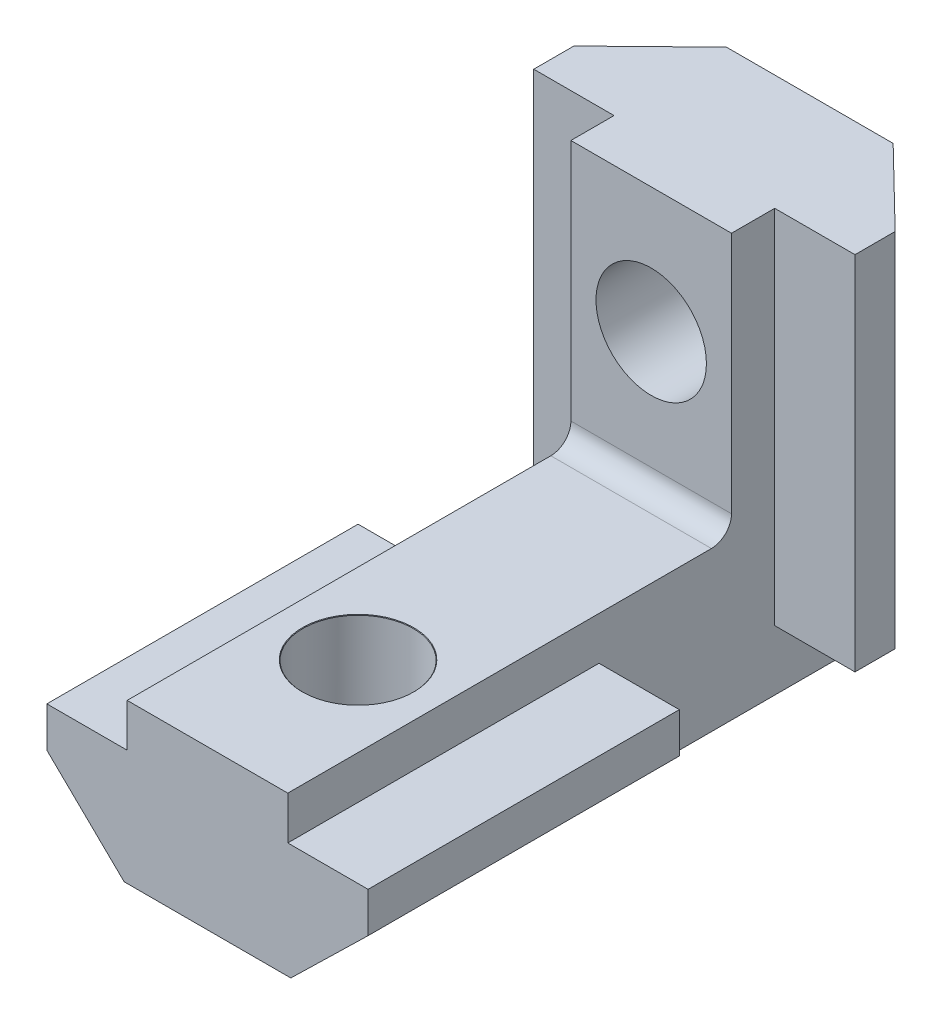
ISO-10303-21;
HEADER;
FILE_DESCRIPTION(('STEP AP214'),'2;1');
FILE_NAME('part.step','',(''),(''),'','','');
FILE_SCHEMA(('AUTOMOTIVE_DESIGN { 1 0 10303 214 1 1 1 1 }'));
ENDSEC;
DATA;
#1=APPLICATION_CONTEXT('core data for automotive mechanical design processes');
#2=APPLICATION_PROTOCOL_DEFINITION('international standard','automotive_design',2000,#1);
#3=PRODUCT_CONTEXT('',#1,'mechanical');
#4=PRODUCT('Part','Part','',(#3));
#5=PRODUCT_RELATED_PRODUCT_CATEGORY('part','',(#4));
#6=PRODUCT_DEFINITION_FORMATION('','',#4);
#7=PRODUCT_DEFINITION_CONTEXT('part definition',#1,'design');
#8=PRODUCT_DEFINITION('design','',#6,#7);
#9=PRODUCT_DEFINITION_SHAPE('','',#8);
#10=(LENGTH_UNIT() NAMED_UNIT(*) SI_UNIT(.MILLI.,.METRE.));
#11=(NAMED_UNIT(*) PLANE_ANGLE_UNIT() SI_UNIT($,.RADIAN.));
#12=(NAMED_UNIT(*) SI_UNIT($,.STERADIAN.) SOLID_ANGLE_UNIT());
#13=UNCERTAINTY_MEASURE_WITH_UNIT(LENGTH_MEASURE(1.E-05),#10,'distance_accuracy_value','');
#14=(GEOMETRIC_REPRESENTATION_CONTEXT(3) GLOBAL_UNCERTAINTY_ASSIGNED_CONTEXT((#13)) GLOBAL_UNIT_ASSIGNED_CONTEXT((#10,
#11,#12)) REPRESENTATION_CONTEXT('',''));
#15=CARTESIAN_POINT('',(0.,0.,0.));
#16=DIRECTION('',(0.,0.,1.));
#17=DIRECTION('',(1.,0.,0.));
#18=AXIS2_PLACEMENT_3D('',#15,#16,#17);
#19=CARTESIAN_POINT('',(-4.,7.9,-15.5));
#20=DIRECTION('',(-1.,0.,0.));
#21=DIRECTION('',(0.,0.,1.));
#22=AXIS2_PLACEMENT_3D('',#19,#20,#21);
#23=PLANE('',#22);
#24=DIRECTION('',(0.,0.,1.));
#25=VECTOR('',#24,1.);
#26=CARTESIAN_POINT('',(-4.,7.9,-15.5));
#27=LINE('',#26,#25);
#28=CARTESIAN_POINT('',(-4.,7.9,-21.1));
#29=VERTEX_POINT('',#28);
#30=CARTESIAN_POINT('',(-4.,7.9,0.));
#31=VERTEX_POINT('',#30);
#32=EDGE_CURVE('E308',#29,#31,#27,.T.);
#33=ORIENTED_EDGE('',*,*,#32,.F.);
#34=CARTESIAN_POINT('',(-4.,8.9,-21.1));
#35=DIRECTION('',(-1.,0.,0.));
#36=DIRECTION('',(0.,0.,1.));
#37=AXIS2_PLACEMENT_3D('',#34,#35,#36);
#38=CIRCLE('',#37,1.);
#39=CARTESIAN_POINT('',(-4.,8.9,-22.1));
#40=VERTEX_POINT('',#39);
#41=EDGE_CURVE('E46',#29,#40,#38,.F.);
#42=ORIENTED_EDGE('',*,*,#41,.T.);
#43=DIRECTION('',(0.,1.,0.));
#44=VECTOR('',#43,1.);
#45=CARTESIAN_POINT('',(-4.,-32.8440466262561,-22.1));
#46=LINE('',#45,#44);
#47=CARTESIAN_POINT('',(-4.,21.,-22.1));
#48=VERTEX_POINT('',#47);
#49=EDGE_CURVE('E250',#40,#48,#46,.T.);
#50=ORIENTED_EDGE('',*,*,#49,.T.);
#51=DIRECTION('',(0.,0.,-1.));
#52=VECTOR('',#51,1.);
#53=CARTESIAN_POINT('',(-4.,21.,-24.25));
#54=LINE('',#53,#52);
#55=CARTESIAN_POINT('',(-4.,21.,-24.25));
#56=VERTEX_POINT('',#55);
#57=EDGE_CURVE('E252',#48,#56,#54,.T.);
#58=ORIENTED_EDGE('',*,*,#57,.T.);
#59=DIRECTION('',(0.,1.,0.));
#60=VECTOR('',#59,1.);
#61=CARTESIAN_POINT('',(-4.,-32.8440466262561,-24.25));
#62=LINE('',#61,#60);
#63=CARTESIAN_POINT('',(-4.,3.,-24.25));
#64=VERTEX_POINT('',#63);
#65=EDGE_CURVE('E253',#64,#56,#62,.T.);
#66=ORIENTED_EDGE('',*,*,#65,.F.);
#67=DIRECTION('',(0.,0.,1.));
#68=VECTOR('',#67,1.);
#69=CARTESIAN_POINT('',(-4.,3.,-15.5));
#70=LINE('',#69,#68);
#71=CARTESIAN_POINT('',(-4.,3.,-30.));
#72=VERTEX_POINT('',#71);
#73=EDGE_CURVE('E221',#72,#64,#70,.T.);
#74=ORIENTED_EDGE('',*,*,#73,.F.);
#75=DIRECTION('',(0.,1.,0.));
#76=VECTOR('',#75,1.);
#77=CARTESIAN_POINT('',(-4.,0.,-30.));
#78=LINE('',#77,#76);
#79=CARTESIAN_POINT('',(-4.,0.,-30.));
#80=VERTEX_POINT('',#79);
#81=EDGE_CURVE('E208',#80,#72,#78,.T.);
#82=ORIENTED_EDGE('',*,*,#81,.F.);
#83=DIRECTION('',(0.,0.,1.));
#84=VECTOR('',#83,1.);
#85=CARTESIAN_POINT('',(-4.,0.,-30.));
#86=LINE('',#85,#84);
#87=CARTESIAN_POINT('',(-4.,0.,-15.5));
#88=VERTEX_POINT('',#87);
#89=EDGE_CURVE('E271',#80,#88,#86,.T.);
#90=ORIENTED_EDGE('',*,*,#89,.T.);
#91=DIRECTION('',(0.,1.,0.));
#92=VECTOR('',#91,1.);
#93=CARTESIAN_POINT('',(-4.,0.,-15.5));
#94=LINE('',#93,#92);
#95=CARTESIAN_POINT('',(-4.,5.75,-15.5));
#96=VERTEX_POINT('',#95);
#97=EDGE_CURVE('E265',#88,#96,#94,.T.);
#98=ORIENTED_EDGE('',*,*,#97,.T.);
#99=DIRECTION('',(0.,0.,1.));
#100=VECTOR('',#99,1.);
#101=CARTESIAN_POINT('',(-4.,5.75,-15.5));
#102=LINE('',#101,#100);
#103=CARTESIAN_POINT('',(-4.,5.75,0.));
#104=VERTEX_POINT('',#103);
#105=EDGE_CURVE('E305',#96,#104,#102,.T.);
#106=ORIENTED_EDGE('',*,*,#105,.T.);
#107=DIRECTION('',(0.,-1.,0.));
#108=VECTOR('',#107,1.);
#109=CARTESIAN_POINT('',(-4.,7.9,0.));
#110=LINE('',#109,#108);
#111=EDGE_CURVE('E331',#31,#104,#110,.T.);
#112=ORIENTED_EDGE('',*,*,#111,.F.);
#113=EDGE_LOOP('',(#33,#42,#50,#58,#66,#74,#82,#90,#98,#106,#112));
#114=FACE_BOUND('',#113,.T.);
#115=ADVANCED_FACE('F38',(#114),#23,.T.);
#116=CARTESIAN_POINT('',(4.,7.9,-15.5));
#117=DIRECTION('',(0.,1.,0.));
#118=DIRECTION('',(0.,0.,1.));
#119=AXIS2_PLACEMENT_3D('',#116,#117,#118);
#120=PLANE('',#119);
#121=CARTESIAN_POINT('',(0.,7.9,-7.5));
#122=DIRECTION('',(0.,1.,0.));
#123=DIRECTION('',(0.,0.,1.));
#124=AXIS2_PLACEMENT_3D('',#121,#122,#123);
#125=CIRCLE('',#124,2.775);
#126=CARTESIAN_POINT('',(0.,7.9,-4.725));
#127=VERTEX_POINT('',#126);
#128=EDGE_CURVE('E494',#127,#127,#125,.T.);
#129=ORIENTED_EDGE('',*,*,#128,.F.);
#130=EDGE_LOOP('',(#129));
#131=FACE_BOUND('',#130,.T.);
#132=DIRECTION('',(0.,0.,1.));
#133=VECTOR('',#132,1.);
#134=CARTESIAN_POINT('',(4.,7.9,-15.5));
#135=LINE('',#134,#133);
#136=CARTESIAN_POINT('',(4.,7.9,-21.1));
#137=VERTEX_POINT('',#136);
#138=CARTESIAN_POINT('',(4.,7.9,0.));
#139=VERTEX_POINT('',#138);
#140=EDGE_CURVE('E294',#137,#139,#135,.T.);
#141=ORIENTED_EDGE('',*,*,#140,.F.);
#142=DIRECTION('',(-1.,0.,0.));
#143=VECTOR('',#142,1.);
#144=CARTESIAN_POINT('',(4.,7.9,-21.1));
#145=LINE('',#144,#143);
#146=EDGE_CURVE('E281',#137,#29,#145,.T.);
#147=ORIENTED_EDGE('',*,*,#146,.T.);
#148=ORIENTED_EDGE('',*,*,#32,.T.);
#149=DIRECTION('',(-1.,0.,0.));
#150=VECTOR('',#149,1.);
#151=CARTESIAN_POINT('',(4.,7.9,0.));
#152=LINE('',#151,#150);
#153=EDGE_CURVE('E375',#139,#31,#152,.T.);
#154=ORIENTED_EDGE('',*,*,#153,.F.);
#155=EDGE_LOOP('',(#141,#147,#148,#154));
#156=FACE_BOUND('',#155,.T.);
#157=ADVANCED_FACE('F325',(#131,#156),#120,.T.);
#158=CARTESIAN_POINT('',(4.,5.75,-15.5));
#159=DIRECTION('',(1.,0.,0.));
#160=DIRECTION('',(0.,0.,-1.));
#161=AXIS2_PLACEMENT_3D('',#158,#159,#160);
#162=PLANE('',#161);
#163=DIRECTION('',(0.,1.,0.));
#164=VECTOR('',#163,1.);
#165=CARTESIAN_POINT('',(4.,-32.8440466262561,-24.25));
#166=LINE('',#165,#164);
#167=CARTESIAN_POINT('',(4.,3.,-24.25));
#168=VERTEX_POINT('',#167);
#169=CARTESIAN_POINT('',(4.,21.,-24.25));
#170=VERTEX_POINT('',#169);
#171=EDGE_CURVE('E244',#168,#170,#166,.T.);
#172=ORIENTED_EDGE('',*,*,#171,.T.);
#173=DIRECTION('',(0.,0.,1.));
#174=VECTOR('',#173,1.);
#175=CARTESIAN_POINT('',(4.,21.,-22.1));
#176=LINE('',#175,#174);
#177=CARTESIAN_POINT('',(4.,21.,-22.1));
#178=VERTEX_POINT('',#177);
#179=EDGE_CURVE('E246',#170,#178,#176,.T.);
#180=ORIENTED_EDGE('',*,*,#179,.T.);
#181=DIRECTION('',(0.,1.,0.));
#182=VECTOR('',#181,1.);
#183=CARTESIAN_POINT('',(4.,-32.8440466262561,-22.1));
#184=LINE('',#183,#182);
#185=CARTESIAN_POINT('',(4.,8.9,-22.1));
#186=VERTEX_POINT('',#185);
#187=EDGE_CURVE('E247',#186,#178,#184,.T.);
#188=ORIENTED_EDGE('',*,*,#187,.F.);
#189=CARTESIAN_POINT('',(4.,8.9,-21.1));
#190=DIRECTION('',(1.,0.,0.));
#191=DIRECTION('',(0.,0.,-1.));
#192=AXIS2_PLACEMENT_3D('',#189,#190,#191);
#193=CIRCLE('',#192,1.);
#194=EDGE_CURVE('E12',#186,#137,#193,.F.);
#195=ORIENTED_EDGE('',*,*,#194,.T.);
#196=ORIENTED_EDGE('',*,*,#140,.T.);
#197=DIRECTION('',(0.,1.,0.));
#198=VECTOR('',#197,1.);
#199=CARTESIAN_POINT('',(4.,5.75,0.));
#200=LINE('',#199,#198);
#201=CARTESIAN_POINT('',(4.,5.75,0.));
#202=VERTEX_POINT('',#201);
#203=EDGE_CURVE('E372',#202,#139,#200,.T.);
#204=ORIENTED_EDGE('',*,*,#203,.F.);
#205=DIRECTION('',(0.,0.,1.));
#206=VECTOR('',#205,1.);
#207=CARTESIAN_POINT('',(4.,5.75,-15.5));
#208=LINE('',#207,#206);
#209=CARTESIAN_POINT('',(4.,5.75,-15.5));
#210=VERTEX_POINT('',#209);
#211=EDGE_CURVE('E292',#210,#202,#208,.T.);
#212=ORIENTED_EDGE('',*,*,#211,.F.);
#213=DIRECTION('',(0.,-1.,0.));
#214=VECTOR('',#213,1.);
#215=CARTESIAN_POINT('',(4.,7.9,-15.5));
#216=LINE('',#215,#214);
#217=CARTESIAN_POINT('',(4.,0.,-15.5));
#218=VERTEX_POINT('',#217);
#219=EDGE_CURVE('E277',#210,#218,#216,.T.);
#220=ORIENTED_EDGE('',*,*,#219,.T.);
#221=DIRECTION('',(0.,0.,1.));
#222=VECTOR('',#221,1.);
#223=CARTESIAN_POINT('',(4.,0.,-30.));
#224=LINE('',#223,#222);
#225=CARTESIAN_POINT('',(4.,0.,-30.));
#226=VERTEX_POINT('',#225);
#227=EDGE_CURVE('E286',#226,#218,#224,.T.);
#228=ORIENTED_EDGE('',*,*,#227,.F.);
#229=DIRECTION('',(0.,-1.,0.));
#230=VECTOR('',#229,1.);
#231=CARTESIAN_POINT('',(4.,7.9,-30.));
#232=LINE('',#231,#230);
#233=CARTESIAN_POINT('',(4.,3.,-30.));
#234=VERTEX_POINT('',#233);
#235=EDGE_CURVE('E266',#234,#226,#232,.T.);
#236=ORIENTED_EDGE('',*,*,#235,.F.);
#237=DIRECTION('',(0.,0.,-1.));
#238=VECTOR('',#237,1.);
#239=CARTESIAN_POINT('',(4.,3.,-15.5));
#240=LINE('',#239,#238);
#241=EDGE_CURVE('E218',#168,#234,#240,.T.);
#242=ORIENTED_EDGE('',*,*,#241,.F.);
#243=EDGE_LOOP('',(#172,#180,#188,#195,#196,#204,#212,#220,#228,#236,#242));
#244=FACE_BOUND('',#243,.T.);
#245=ADVANCED_FACE('F411',(#244),#162,.T.);
#246=CARTESIAN_POINT('',(0.,0.,-15.5));
#247=DIRECTION('',(0.,0.,-1.));
#248=DIRECTION('',(-1.,0.,0.));
#249=AXIS2_PLACEMENT_3D('',#246,#247,#248);
#250=PLANE('',#249);
#251=ORIENTED_EDGE('',*,*,#97,.F.);
#252=DIRECTION('',(1.,0.,0.));
#253=VECTOR('',#252,1.);
#254=CARTESIAN_POINT('',(-4.15,0.,-15.5));
#255=LINE('',#254,#253);
#256=CARTESIAN_POINT('',(-4.15,0.,-15.5));
#257=VERTEX_POINT('',#256);
#258=EDGE_CURVE('E344',#257,#88,#255,.T.);
#259=ORIENTED_EDGE('',*,*,#258,.F.);
#260=DIRECTION('',(0.7163488096607,-0.697742347072111,0.));
#261=VECTOR('',#260,1.);
#262=CARTESIAN_POINT('',(-4.15,0.,-15.5));
#263=LINE('',#262,#261);
#264=CARTESIAN_POINT('',(-8.,3.75,-15.5));
#265=VERTEX_POINT('',#264);
#266=EDGE_CURVE('E350',#265,#257,#263,.T.);
#267=ORIENTED_EDGE('',*,*,#266,.F.);
#268=DIRECTION('',(0.,-1.,0.));
#269=VECTOR('',#268,1.);
#270=CARTESIAN_POINT('',(-8.,3.75,-15.5));
#271=LINE('',#270,#269);
#272=CARTESIAN_POINT('',(-8.,5.75,-15.5));
#273=VERTEX_POINT('',#272);
#274=EDGE_CURVE('E313',#273,#265,#271,.T.);
#275=ORIENTED_EDGE('',*,*,#274,.F.);
#276=DIRECTION('',(-1.,0.,0.));
#277=VECTOR('',#276,1.);
#278=CARTESIAN_POINT('',(-4.,5.75,-15.5));
#279=LINE('',#278,#277);
#280=EDGE_CURVE('E301',#96,#273,#279,.T.);
#281=ORIENTED_EDGE('',*,*,#280,.F.);
#282=EDGE_LOOP('',(#251,#259,#267,#275,#281));
#283=FACE_BOUND('',#282,.T.);
#284=ADVANCED_FACE('F403',(#283),#250,.T.);
#285=CARTESIAN_POINT('',(-4.15,0.,-15.5));
#286=DIRECTION('',(-0.697742347072111,-0.7163488096607,0.));
#287=DIRECTION('',(0.7163488096607,-0.697742347072111,0.));
#288=AXIS2_PLACEMENT_3D('',#285,#286,#287);
#289=PLANE('',#288);
#290=DIRECTION('',(0.7163488096607,-0.697742347072111,0.));
#291=VECTOR('',#290,1.);
#292=CARTESIAN_POINT('',(-4.15,0.,0.));
#293=LINE('',#292,#291);
#294=CARTESIAN_POINT('',(-8.,3.75,0.));
#295=VERTEX_POINT('',#294);
#296=CARTESIAN_POINT('',(-4.15,0.,0.));
#297=VERTEX_POINT('',#296);
#298=EDGE_CURVE('E289',#295,#297,#293,.T.);
#299=ORIENTED_EDGE('',*,*,#298,.F.);
#300=DIRECTION('',(0.,0.,1.));
#301=VECTOR('',#300,1.);
#302=CARTESIAN_POINT('',(-8.,3.75,-15.5));
#303=LINE('',#302,#301);
#304=EDGE_CURVE('E282',#265,#295,#303,.T.);
#305=ORIENTED_EDGE('',*,*,#304,.F.);
#306=ORIENTED_EDGE('',*,*,#266,.T.);
#307=DIRECTION('',(0.,0.,1.));
#308=VECTOR('',#307,1.);
#309=CARTESIAN_POINT('',(-4.15,0.,-15.5));
#310=LINE('',#309,#308);
#311=EDGE_CURVE('E343',#257,#297,#310,.T.);
#312=ORIENTED_EDGE('',*,*,#311,.T.);
#313=EDGE_LOOP('',(#299,#305,#306,#312));
#314=FACE_BOUND('',#313,.T.);
#315=ADVANCED_FACE('F395',(#314),#289,.T.);
#316=CARTESIAN_POINT('',(-8.,3.75,-15.5));
#317=DIRECTION('',(-1.,0.,0.));
#318=DIRECTION('',(0.,0.,1.));
#319=AXIS2_PLACEMENT_3D('',#316,#317,#318);
#320=PLANE('',#319);
#321=DIRECTION('',(0.,-1.,0.));
#322=VECTOR('',#321,1.);
#323=CARTESIAN_POINT('',(-8.,3.75,0.));
#324=LINE('',#323,#322);
#325=CARTESIAN_POINT('',(-8.,5.75,0.));
#326=VERTEX_POINT('',#325);
#327=EDGE_CURVE('E381',#326,#295,#324,.T.);
#328=ORIENTED_EDGE('',*,*,#327,.F.);
#329=DIRECTION('',(0.,0.,1.));
#330=VECTOR('',#329,1.);
#331=CARTESIAN_POINT('',(-8.,5.75,-15.5));
#332=LINE('',#331,#330);
#333=EDGE_CURVE('E307',#273,#326,#332,.T.);
#334=ORIENTED_EDGE('',*,*,#333,.F.);
#335=ORIENTED_EDGE('',*,*,#274,.T.);
#336=ORIENTED_EDGE('',*,*,#304,.T.);
#337=EDGE_LOOP('',(#328,#334,#335,#336));
#338=FACE_BOUND('',#337,.T.);
#339=ADVANCED_FACE('F393',(#338),#320,.T.);
#340=CARTESIAN_POINT('',(-4.,5.75,-15.5));
#341=DIRECTION('',(0.,1.,0.));
#342=DIRECTION('',(0.,0.,1.));
#343=AXIS2_PLACEMENT_3D('',#340,#341,#342);
#344=PLANE('',#343);
#345=DIRECTION('',(-1.,0.,0.));
#346=VECTOR('',#345,1.);
#347=CARTESIAN_POINT('',(-4.,5.75,0.));
#348=LINE('',#347,#346);
#349=EDGE_CURVE('E378',#104,#326,#348,.T.);
#350=ORIENTED_EDGE('',*,*,#349,.F.);
#351=ORIENTED_EDGE('',*,*,#105,.F.);
#352=ORIENTED_EDGE('',*,*,#280,.T.);
#353=ORIENTED_EDGE('',*,*,#333,.T.);
#354=EDGE_LOOP('',(#350,#351,#352,#353));
#355=FACE_BOUND('',#354,.T.);
#356=ADVANCED_FACE('F388',(#355),#344,.T.);
#357=CARTESIAN_POINT('',(8.,5.75,-15.5));
#358=DIRECTION('',(0.,1.,0.));
#359=DIRECTION('',(0.,0.,1.));
#360=AXIS2_PLACEMENT_3D('',#357,#358,#359);
#361=PLANE('',#360);
#362=DIRECTION('',(-1.,0.,0.));
#363=VECTOR('',#362,1.);
#364=CARTESIAN_POINT('',(8.,5.75,0.));
#365=LINE('',#364,#363);
#366=CARTESIAN_POINT('',(8.,5.75,0.));
#367=VERTEX_POINT('',#366);
#368=EDGE_CURVE('E369',#367,#202,#365,.T.);
#369=ORIENTED_EDGE('',*,*,#368,.F.);
#370=DIRECTION('',(0.,0.,1.));
#371=VECTOR('',#370,1.);
#372=CARTESIAN_POINT('',(8.,5.75,-15.5));
#373=LINE('',#372,#371);
#374=CARTESIAN_POINT('',(8.,5.75,-15.5));
#375=VERTEX_POINT('',#374);
#376=EDGE_CURVE('E295',#375,#367,#373,.T.);
#377=ORIENTED_EDGE('',*,*,#376,.F.);
#378=DIRECTION('',(-1.,0.,0.));
#379=VECTOR('',#378,1.);
#380=CARTESIAN_POINT('',(8.,5.75,-15.5));
#381=LINE('',#380,#379);
#382=EDGE_CURVE('E298',#375,#210,#381,.T.);
#383=ORIENTED_EDGE('',*,*,#382,.T.);
#384=ORIENTED_EDGE('',*,*,#211,.T.);
#385=EDGE_LOOP('',(#369,#377,#383,#384));
#386=FACE_BOUND('',#385,.T.);
#387=ADVANCED_FACE('F401',(#386),#361,.T.);
#388=CARTESIAN_POINT('',(8.,3.75,-15.5));
#389=DIRECTION('',(1.,0.,0.));
#390=DIRECTION('',(0.,0.,-1.));
#391=AXIS2_PLACEMENT_3D('',#388,#389,#390);
#392=PLANE('',#391);
#393=DIRECTION('',(0.,1.,0.));
#394=VECTOR('',#393,1.);
#395=CARTESIAN_POINT('',(8.,3.75,0.));
#396=LINE('',#395,#394);
#397=CARTESIAN_POINT('',(8.,3.75,0.));
#398=VERTEX_POINT('',#397);
#399=EDGE_CURVE('E366',#398,#367,#396,.T.);
#400=ORIENTED_EDGE('',*,*,#399,.F.);
#401=DIRECTION('',(0.,0.,1.));
#402=VECTOR('',#401,1.);
#403=CARTESIAN_POINT('',(8.,3.75,-15.5));
#404=LINE('',#403,#402);
#405=CARTESIAN_POINT('',(8.,3.75,-15.5));
#406=VERTEX_POINT('',#405);
#407=EDGE_CURVE('E339',#406,#398,#404,.T.);
#408=ORIENTED_EDGE('',*,*,#407,.F.);
#409=DIRECTION('',(0.,1.,0.));
#410=VECTOR('',#409,1.);
#411=CARTESIAN_POINT('',(8.,3.75,-15.5));
#412=LINE('',#411,#410);
#413=EDGE_CURVE('E302',#406,#375,#412,.T.);
#414=ORIENTED_EDGE('',*,*,#413,.T.);
#415=ORIENTED_EDGE('',*,*,#376,.T.);
#416=EDGE_LOOP('',(#400,#408,#414,#415));
#417=FACE_BOUND('',#416,.T.);
#418=ADVANCED_FACE('F420',(#417),#392,.T.);
#419=CARTESIAN_POINT('',(4.15,0.,-15.5));
#420=DIRECTION('',(0.697742347072111,-0.7163488096607,0.));
#421=DIRECTION('',(0.7163488096607,0.697742347072111,0.));
#422=AXIS2_PLACEMENT_3D('',#419,#420,#421);
#423=PLANE('',#422);
#424=DIRECTION('',(0.7163488096607,0.697742347072111,0.));
#425=VECTOR('',#424,1.);
#426=CARTESIAN_POINT('',(4.15,0.,0.));
#427=LINE('',#426,#425);
#428=CARTESIAN_POINT('',(4.15,0.,0.));
#429=VERTEX_POINT('',#428);
#430=EDGE_CURVE('E363',#429,#398,#427,.T.);
#431=ORIENTED_EDGE('',*,*,#430,.F.);
#432=DIRECTION('',(0.,0.,1.));
#433=VECTOR('',#432,1.);
#434=CARTESIAN_POINT('',(4.15,0.,-15.5));
#435=LINE('',#434,#433);
#436=CARTESIAN_POINT('',(4.15,0.,-15.5));
#437=VERTEX_POINT('',#436);
#438=EDGE_CURVE('E341',#437,#429,#435,.T.);
#439=ORIENTED_EDGE('',*,*,#438,.F.);
#440=DIRECTION('',(0.7163488096607,0.697742347072111,0.));
#441=VECTOR('',#440,1.);
#442=CARTESIAN_POINT('',(4.15,0.,-15.5));
#443=LINE('',#442,#441);
#444=EDGE_CURVE('E346',#437,#406,#443,.T.);
#445=ORIENTED_EDGE('',*,*,#444,.T.);
#446=ORIENTED_EDGE('',*,*,#407,.T.);
#447=EDGE_LOOP('',(#431,#439,#445,#446));
#448=FACE_BOUND('',#447,.T.);
#449=ADVANCED_FACE('F424',(#448),#423,.T.);
#450=CARTESIAN_POINT('',(-4.15,0.,-15.5));
#451=DIRECTION('',(0.,-1.,0.));
#452=DIRECTION('',(0.,0.,-1.));
#453=AXIS2_PLACEMENT_3D('',#450,#451,#452);
#454=PLANE('',#453);
#455=CARTESIAN_POINT('',(0.,0.,-7.5));
#456=DIRECTION('',(0.,-1.,0.));
#457=DIRECTION('',(0.,0.,-1.));
#458=AXIS2_PLACEMENT_3D('',#455,#456,#457);
#459=CIRCLE('',#458,2.75);
#460=CARTESIAN_POINT('',(0.,0.,-10.25));
#461=VERTEX_POINT('',#460);
#462=EDGE_CURVE('E262',#461,#461,#459,.T.);
#463=ORIENTED_EDGE('',*,*,#462,.F.);
#464=EDGE_LOOP('',(#463));
#465=FACE_BOUND('',#464,.T.);
#466=DIRECTION('',(1.,0.,0.));
#467=VECTOR('',#466,1.);
#468=CARTESIAN_POINT('',(-4.15,0.,0.));
#469=LINE('',#468,#467);
#470=EDGE_CURVE('E360',#297,#429,#469,.T.);
#471=ORIENTED_EDGE('',*,*,#470,.F.);
#472=ORIENTED_EDGE('',*,*,#311,.F.);
#473=ORIENTED_EDGE('',*,*,#258,.T.);
#474=ORIENTED_EDGE('',*,*,#89,.F.);
#475=DIRECTION('',(-1.,0.,0.));
#476=VECTOR('',#475,1.);
#477=CARTESIAN_POINT('',(4.,0.,-30.));
#478=LINE('',#477,#476);
#479=EDGE_CURVE('E268',#226,#80,#478,.T.);
#480=ORIENTED_EDGE('',*,*,#479,.F.);
#481=ORIENTED_EDGE('',*,*,#227,.T.);
#482=EDGE_CURVE('E283',#218,#437,#255,.T.);
#483=ORIENTED_EDGE('',*,*,#482,.T.);
#484=ORIENTED_EDGE('',*,*,#438,.T.);
#485=EDGE_LOOP('',(#471,#472,#473,#474,#480,#481,#483,#484));
#486=FACE_BOUND('',#485,.T.);
#487=ADVANCED_FACE('F428',(#465,#486),#454,.T.);
#488=ORIENTED_EDGE('',*,*,#219,.F.);
#489=ORIENTED_EDGE('',*,*,#382,.F.);
#490=ORIENTED_EDGE('',*,*,#413,.F.);
#491=ORIENTED_EDGE('',*,*,#444,.F.);
#492=ORIENTED_EDGE('',*,*,#482,.F.);
#493=EDGE_LOOP('',(#488,#489,#490,#491,#492));
#494=FACE_BOUND('',#493,.T.);
#495=ADVANCED_FACE('F431',(#494),#250,.T.);
#496=CARTESIAN_POINT('',(0.,0.,0.));
#497=DIRECTION('',(0.,0.,-1.));
#498=DIRECTION('',(-1.,0.,0.));
#499=AXIS2_PLACEMENT_3D('',#496,#497,#498);
#500=PLANE('',#499);
#501=ORIENTED_EDGE('',*,*,#298,.T.);
#502=ORIENTED_EDGE('',*,*,#470,.T.);
#503=ORIENTED_EDGE('',*,*,#430,.T.);
#504=ORIENTED_EDGE('',*,*,#399,.T.);
#505=ORIENTED_EDGE('',*,*,#368,.T.);
#506=ORIENTED_EDGE('',*,*,#203,.T.);
#507=ORIENTED_EDGE('',*,*,#153,.T.);
#508=ORIENTED_EDGE('',*,*,#111,.T.);
#509=ORIENTED_EDGE('',*,*,#349,.T.);
#510=ORIENTED_EDGE('',*,*,#327,.T.);
#511=EDGE_LOOP('',(#501,#502,#503,#504,#505,#506,#507,#508,#509,#510));
#512=FACE_BOUND('',#511,.T.);
#513=ADVANCED_FACE('F392',(#512),#500,.F.);
#514=CARTESIAN_POINT('',(0.,0.,-30.));
#515=DIRECTION('',(0.,0.,-1.));
#516=DIRECTION('',(-1.,0.,0.));
#517=AXIS2_PLACEMENT_3D('',#514,#515,#516);
#518=PLANE('',#517);
#519=CARTESIAN_POINT('',(0.,14.75,-30.));
#520=DIRECTION('',(0.,0.,-1.));
#521=DIRECTION('',(-1.,0.,0.));
#522=AXIS2_PLACEMENT_3D('',#519,#520,#521);
#523=CIRCLE('',#522,2.75);
#524=CARTESIAN_POINT('',(-2.75,14.75,-30.));
#525=VERTEX_POINT('',#524);
#526=EDGE_CURVE('E492',#525,#525,#523,.T.);
#527=ORIENTED_EDGE('',*,*,#526,.F.);
#528=EDGE_LOOP('',(#527));
#529=FACE_BOUND('',#528,.T.);
#530=ORIENTED_EDGE('',*,*,#81,.T.);
#531=DIRECTION('',(1.,0.,0.));
#532=VECTOR('',#531,1.);
#533=CARTESIAN_POINT('',(4.15,3.,-30.));
#534=LINE('',#533,#532);
#535=CARTESIAN_POINT('',(-4.15,3.,-30.));
#536=VERTEX_POINT('',#535);
#537=EDGE_CURVE('E205',#536,#72,#534,.T.);
#538=ORIENTED_EDGE('',*,*,#537,.F.);
#539=DIRECTION('',(0.,1.,0.));
#540=VECTOR('',#539,1.);
#541=CARTESIAN_POINT('',(-4.15,-32.8440466262561,-30.));
#542=LINE('',#541,#540);
#543=CARTESIAN_POINT('',(-4.15,21.,-30.));
#544=VERTEX_POINT('',#543);
#545=EDGE_CURVE('E190',#536,#544,#542,.T.);
#546=ORIENTED_EDGE('',*,*,#545,.T.);
#547=DIRECTION('',(1.,0.,0.));
#548=VECTOR('',#547,1.);
#549=CARTESIAN_POINT('',(4.15,21.,-30.));
#550=LINE('',#549,#548);
#551=CARTESIAN_POINT('',(4.15,21.,-30.));
#552=VERTEX_POINT('',#551);
#553=EDGE_CURVE('E201',#544,#552,#550,.T.);
#554=ORIENTED_EDGE('',*,*,#553,.T.);
#555=DIRECTION('',(0.,1.,0.));
#556=VECTOR('',#555,1.);
#557=CARTESIAN_POINT('',(4.15,-32.8440466262561,-30.));
#558=LINE('',#557,#556);
#559=CARTESIAN_POINT('',(4.15,3.,-30.));
#560=VERTEX_POINT('',#559);
#561=EDGE_CURVE('E261',#560,#552,#558,.T.);
#562=ORIENTED_EDGE('',*,*,#561,.F.);
#563=EDGE_CURVE('E212',#234,#560,#534,.T.);
#564=ORIENTED_EDGE('',*,*,#563,.F.);
#565=ORIENTED_EDGE('',*,*,#235,.T.);
#566=ORIENTED_EDGE('',*,*,#479,.T.);
#567=EDGE_LOOP('',(#530,#538,#546,#554,#562,#564,#565,#566));
#568=FACE_BOUND('',#567,.T.);
#569=ADVANCED_FACE('F206',(#529,#568),#518,.T.);
#570=CARTESIAN_POINT('',(0.,3.,0.));
#571=DIRECTION('',(0.,-1.,0.));
#572=DIRECTION('',(0.,0.,-1.));
#573=AXIS2_PLACEMENT_3D('',#570,#571,#572);
#574=PLANE('',#573);
#575=ORIENTED_EDGE('',*,*,#537,.T.);
#576=ORIENTED_EDGE('',*,*,#73,.T.);
#577=DIRECTION('',(-1.,0.,0.));
#578=VECTOR('',#577,1.);
#579=CARTESIAN_POINT('',(-8.,3.,-24.25));
#580=LINE('',#579,#578);
#581=CARTESIAN_POINT('',(-8.,3.,-24.25));
#582=VERTEX_POINT('',#581);
#583=EDGE_CURVE('E223',#64,#582,#580,.T.);
#584=ORIENTED_EDGE('',*,*,#583,.T.);
#585=DIRECTION('',(0.,0.,-1.));
#586=VECTOR('',#585,1.);
#587=CARTESIAN_POINT('',(-8.,3.,-24.25));
#588=LINE('',#587,#586);
#589=CARTESIAN_POINT('',(-8.,3.,-26.25));
#590=VERTEX_POINT('',#589);
#591=EDGE_CURVE('E217',#582,#590,#588,.T.);
#592=ORIENTED_EDGE('',*,*,#591,.T.);
#593=DIRECTION('',(0.7163488096607,0.,-0.697742347072111));
#594=VECTOR('',#593,1.);
#595=CARTESIAN_POINT('',(-4.15,3.,-30.));
#596=LINE('',#595,#594);
#597=EDGE_CURVE('E194',#590,#536,#596,.T.);
#598=ORIENTED_EDGE('',*,*,#597,.T.);
#599=EDGE_LOOP('',(#575,#576,#584,#592,#598));
#600=FACE_BOUND('',#599,.T.);
#601=ADVANCED_FACE('F215',(#600),#574,.T.);
#602=CARTESIAN_POINT('',(4.15,-32.8440466262561,-30.));
#603=DIRECTION('',(-0.697742347072111,0.,0.7163488096607));
#604=DIRECTION('',(0.7163488096607,0.,0.697742347072111));
#605=AXIS2_PLACEMENT_3D('',#602,#603,#604);
#606=PLANE('',#605);
#607=DIRECTION('',(0.7163488096607,0.,0.697742347072111));
#608=VECTOR('',#607,1.);
#609=CARTESIAN_POINT('',(4.15,3.,-30.));
#610=LINE('',#609,#608);
#611=CARTESIAN_POINT('',(8.,3.,-26.25));
#612=VERTEX_POINT('',#611);
#613=EDGE_CURVE('E211',#560,#612,#610,.T.);
#614=ORIENTED_EDGE('',*,*,#613,.F.);
#615=ORIENTED_EDGE('',*,*,#561,.T.);
#616=DIRECTION('',(0.7163488096607,0.,0.697742347072111));
#617=VECTOR('',#616,1.);
#618=CARTESIAN_POINT('',(4.15,21.,-30.));
#619=LINE('',#618,#617);
#620=CARTESIAN_POINT('',(8.,21.,-26.25));
#621=VERTEX_POINT('',#620);
#622=EDGE_CURVE('E226',#552,#621,#619,.T.);
#623=ORIENTED_EDGE('',*,*,#622,.T.);
#624=DIRECTION('',(0.,1.,0.));
#625=VECTOR('',#624,1.);
#626=CARTESIAN_POINT('',(8.,-32.8440466262561,-26.25));
#627=LINE('',#626,#625);
#628=EDGE_CURVE('E238',#612,#621,#627,.T.);
#629=ORIENTED_EDGE('',*,*,#628,.F.);
#630=EDGE_LOOP('',(#614,#615,#623,#629));
#631=FACE_BOUND('',#630,.T.);
#632=ADVANCED_FACE('F479',(#631),#606,.F.);
#633=CARTESIAN_POINT('',(8.,-32.8440466262561,-24.25));
#634=DIRECTION('',(-1.,0.,0.));
#635=DIRECTION('',(0.,0.,1.));
#636=AXIS2_PLACEMENT_3D('',#633,#634,#635);
#637=PLANE('',#636);
#638=DIRECTION('',(0.,0.,1.));
#639=VECTOR('',#638,1.);
#640=CARTESIAN_POINT('',(8.,3.,-24.25));
#641=LINE('',#640,#639);
#642=CARTESIAN_POINT('',(8.,3.,-24.25));
#643=VERTEX_POINT('',#642);
#644=EDGE_CURVE('E233',#612,#643,#641,.T.);
#645=ORIENTED_EDGE('',*,*,#644,.F.);
#646=ORIENTED_EDGE('',*,*,#628,.T.);
#647=DIRECTION('',(0.,0.,1.));
#648=VECTOR('',#647,1.);
#649=CARTESIAN_POINT('',(8.,21.,-24.25));
#650=LINE('',#649,#648);
#651=CARTESIAN_POINT('',(8.,21.,-24.25));
#652=VERTEX_POINT('',#651);
#653=EDGE_CURVE('E240',#621,#652,#650,.T.);
#654=ORIENTED_EDGE('',*,*,#653,.T.);
#655=DIRECTION('',(0.,1.,0.));
#656=VECTOR('',#655,1.);
#657=CARTESIAN_POINT('',(8.,-32.8440466262561,-24.25));
#658=LINE('',#657,#656);
#659=EDGE_CURVE('E241',#643,#652,#658,.T.);
#660=ORIENTED_EDGE('',*,*,#659,.F.);
#661=EDGE_LOOP('',(#645,#646,#654,#660));
#662=FACE_BOUND('',#661,.T.);
#663=ADVANCED_FACE('F484',(#662),#637,.F.);
#664=CARTESIAN_POINT('',(4.,-32.8440466262561,-24.25));
#665=DIRECTION('',(0.,0.,-1.));
#666=DIRECTION('',(-1.,0.,0.));
#667=AXIS2_PLACEMENT_3D('',#664,#665,#666);
#668=PLANE('',#667);
#669=DIRECTION('',(-1.,0.,0.));
#670=VECTOR('',#669,1.);
#671=CARTESIAN_POINT('',(4.,3.,-24.25));
#672=LINE('',#671,#670);
#673=EDGE_CURVE('E230',#643,#168,#672,.T.);
#674=ORIENTED_EDGE('',*,*,#673,.F.);
#675=ORIENTED_EDGE('',*,*,#659,.T.);
#676=DIRECTION('',(-1.,0.,0.));
#677=VECTOR('',#676,1.);
#678=CARTESIAN_POINT('',(4.,21.,-24.25));
#679=LINE('',#678,#677);
#680=EDGE_CURVE('E243',#652,#170,#679,.T.);
#681=ORIENTED_EDGE('',*,*,#680,.T.);
#682=ORIENTED_EDGE('',*,*,#171,.F.);
#683=EDGE_LOOP('',(#674,#675,#681,#682));
#684=FACE_BOUND('',#683,.T.);
#685=ADVANCED_FACE('F530',(#684),#668,.F.);
#686=CARTESIAN_POINT('',(-4.,-32.8440466262561,-22.1));
#687=DIRECTION('',(0.,0.,-1.));
#688=DIRECTION('',(-1.,0.,0.));
#689=AXIS2_PLACEMENT_3D('',#686,#687,#688);
#690=PLANE('',#689);
#691=CARTESIAN_POINT('',(0.,14.75,-22.1));
#692=DIRECTION('',(0.,0.,1.));
#693=DIRECTION('',(1.,0.,0.));
#694=AXIS2_PLACEMENT_3D('',#691,#692,#693);
#695=CIRCLE('',#694,2.75);
#696=CARTESIAN_POINT('',(2.75,14.75,-22.1));
#697=VERTEX_POINT('',#696);
#698=EDGE_CURVE('E495',#697,#697,#695,.T.);
#699=ORIENTED_EDGE('',*,*,#698,.F.);
#700=EDGE_LOOP('',(#699));
#701=FACE_BOUND('',#700,.T.);
#702=ORIENTED_EDGE('',*,*,#49,.F.);
#703=DIRECTION('',(-1.,0.,0.));
#704=VECTOR('',#703,1.);
#705=CARTESIAN_POINT('',(-4.,8.9,-22.1));
#706=LINE('',#705,#704);
#707=EDGE_CURVE('E59',#40,#186,#706,.F.);
#708=ORIENTED_EDGE('',*,*,#707,.T.);
#709=ORIENTED_EDGE('',*,*,#187,.T.);
#710=DIRECTION('',(-1.,0.,0.));
#711=VECTOR('',#710,1.);
#712=CARTESIAN_POINT('',(-4.,21.,-22.1));
#713=LINE('',#712,#711);
#714=EDGE_CURVE('E249',#178,#48,#713,.T.);
#715=ORIENTED_EDGE('',*,*,#714,.T.);
#716=EDGE_LOOP('',(#702,#708,#709,#715));
#717=FACE_BOUND('',#716,.T.);
#718=ADVANCED_FACE('F545',(#701,#717),#690,.F.);
#719=CARTESIAN_POINT('',(-8.,-32.8440466262561,-24.25));
#720=DIRECTION('',(0.,0.,-1.));
#721=DIRECTION('',(-1.,0.,0.));
#722=AXIS2_PLACEMENT_3D('',#719,#720,#721);
#723=PLANE('',#722);
#724=ORIENTED_EDGE('',*,*,#583,.F.);
#725=ORIENTED_EDGE('',*,*,#65,.T.);
#726=DIRECTION('',(-1.,0.,0.));
#727=VECTOR('',#726,1.);
#728=CARTESIAN_POINT('',(-8.,21.,-24.25));
#729=LINE('',#728,#727);
#730=CARTESIAN_POINT('',(-8.,21.,-24.25));
#731=VERTEX_POINT('',#730);
#732=EDGE_CURVE('E255',#56,#731,#729,.T.);
#733=ORIENTED_EDGE('',*,*,#732,.T.);
#734=DIRECTION('',(0.,1.,0.));
#735=VECTOR('',#734,1.);
#736=CARTESIAN_POINT('',(-8.,-32.8440466262561,-24.25));
#737=LINE('',#736,#735);
#738=EDGE_CURVE('E256',#582,#731,#737,.T.);
#739=ORIENTED_EDGE('',*,*,#738,.F.);
#740=EDGE_LOOP('',(#724,#725,#733,#739));
#741=FACE_BOUND('',#740,.T.);
#742=ADVANCED_FACE('F540',(#741),#723,.F.);
#743=CARTESIAN_POINT('',(-8.,-32.8440466262561,-24.25));
#744=DIRECTION('',(1.,0.,0.));
#745=DIRECTION('',(0.,0.,-1.));
#746=AXIS2_PLACEMENT_3D('',#743,#744,#745);
#747=PLANE('',#746);
#748=ORIENTED_EDGE('',*,*,#591,.F.);
#749=ORIENTED_EDGE('',*,*,#738,.T.);
#750=DIRECTION('',(0.,0.,-1.));
#751=VECTOR('',#750,1.);
#752=CARTESIAN_POINT('',(-8.,21.,-24.25));
#753=LINE('',#752,#751);
#754=CARTESIAN_POINT('',(-8.,21.,-26.25));
#755=VERTEX_POINT('',#754);
#756=EDGE_CURVE('E258',#731,#755,#753,.T.);
#757=ORIENTED_EDGE('',*,*,#756,.T.);
#758=DIRECTION('',(0.,1.,0.));
#759=VECTOR('',#758,1.);
#760=CARTESIAN_POINT('',(-8.,-32.8440466262561,-26.25));
#761=LINE('',#760,#759);
#762=EDGE_CURVE('E259',#590,#755,#761,.T.);
#763=ORIENTED_EDGE('',*,*,#762,.F.);
#764=EDGE_LOOP('',(#748,#749,#757,#763));
#765=FACE_BOUND('',#764,.T.);
#766=ADVANCED_FACE('F543',(#765),#747,.F.);
#767=CARTESIAN_POINT('',(-4.15,-32.8440466262561,-30.));
#768=DIRECTION('',(0.697742347072111,0.,0.7163488096607));
#769=DIRECTION('',(0.7163488096607,0.,-0.697742347072111));
#770=AXIS2_PLACEMENT_3D('',#767,#768,#769);
#771=PLANE('',#770);
#772=ORIENTED_EDGE('',*,*,#597,.F.);
#773=ORIENTED_EDGE('',*,*,#762,.T.);
#774=DIRECTION('',(0.7163488096607,0.,-0.697742347072111));
#775=VECTOR('',#774,1.);
#776=CARTESIAN_POINT('',(-4.15,21.,-30.));
#777=LINE('',#776,#775);
#778=EDGE_CURVE('E197',#755,#544,#777,.T.);
#779=ORIENTED_EDGE('',*,*,#778,.T.);
#780=ORIENTED_EDGE('',*,*,#545,.F.);
#781=EDGE_LOOP('',(#772,#773,#779,#780));
#782=FACE_BOUND('',#781,.T.);
#783=ADVANCED_FACE('F192',(#782),#771,.F.);
#784=CARTESIAN_POINT('',(0.,21.,0.));
#785=DIRECTION('',(0.,-1.,0.));
#786=DIRECTION('',(0.,0.,-1.));
#787=AXIS2_PLACEMENT_3D('',#784,#785,#786);
#788=PLANE('',#787);
#789=ORIENTED_EDGE('',*,*,#622,.F.);
#790=ORIENTED_EDGE('',*,*,#553,.F.);
#791=ORIENTED_EDGE('',*,*,#778,.F.);
#792=ORIENTED_EDGE('',*,*,#756,.F.);
#793=ORIENTED_EDGE('',*,*,#732,.F.);
#794=ORIENTED_EDGE('',*,*,#57,.F.);
#795=ORIENTED_EDGE('',*,*,#714,.F.);
#796=ORIENTED_EDGE('',*,*,#179,.F.);
#797=ORIENTED_EDGE('',*,*,#680,.F.);
#798=ORIENTED_EDGE('',*,*,#653,.F.);
#799=EDGE_LOOP('',(#789,#790,#791,#792,#793,#794,#795,#796,#797,#798));
#800=FACE_BOUND('',#799,.T.);
#801=ADVANCED_FACE('F468',(#800),#788,.F.);
#802=ORIENTED_EDGE('',*,*,#673,.T.);
#803=ORIENTED_EDGE('',*,*,#241,.T.);
#804=ORIENTED_EDGE('',*,*,#563,.T.);
#805=ORIENTED_EDGE('',*,*,#613,.T.);
#806=ORIENTED_EDGE('',*,*,#644,.T.);
#807=EDGE_LOOP('',(#802,#803,#804,#805,#806));
#808=FACE_BOUND('',#807,.T.);
#809=ADVANCED_FACE('F460',(#808),#574,.T.);
#810=CARTESIAN_POINT('',(4.,8.9,-21.1));
#811=DIRECTION('',(-1.,0.,0.));
#812=DIRECTION('',(0.,0.,1.));
#813=AXIS2_PLACEMENT_3D('',#810,#811,#812);
#814=CYLINDRICAL_SURFACE('',#813,1.);
#815=ORIENTED_EDGE('',*,*,#194,.F.);
#816=ORIENTED_EDGE('',*,*,#707,.F.);
#817=ORIENTED_EDGE('',*,*,#41,.F.);
#818=ORIENTED_EDGE('',*,*,#146,.F.);
#819=EDGE_LOOP('',(#815,#816,#817,#818));
#820=FACE_BOUND('',#819,.T.);
#821=ADVANCED_FACE('F40',(#820),#814,.F.);
#822=CARTESIAN_POINT('',(0.,7.9,-7.5));
#823=DIRECTION('',(0.,1.,0.));
#824=DIRECTION('',(0.,0.,1.));
#825=AXIS2_PLACEMENT_3D('',#822,#823,#824);
#826=CYLINDRICAL_SURFACE('',#825,2.75);
#827=CARTESIAN_POINT('',(0.,7.875,-7.5));
#828=DIRECTION('',(0.,1.,0.));
#829=DIRECTION('',(0.,0.,1.));
#830=AXIS2_PLACEMENT_3D('',#827,#828,#829);
#831=CIRCLE('',#830,2.75);
#832=CARTESIAN_POINT('',(0.,7.875,-4.75));
#833=VERTEX_POINT('',#832);
#834=EDGE_CURVE('E498',#833,#833,#831,.T.);
#835=ORIENTED_EDGE('',*,*,#834,.T.);
#836=EDGE_LOOP('',(#835));
#837=FACE_BOUND('',#836,.T.);
#838=ORIENTED_EDGE('',*,*,#462,.T.);
#839=EDGE_LOOP('',(#838));
#840=FACE_BOUND('',#839,.T.);
#841=ADVANCED_FACE('F459',(#837,#840),#826,.F.);
#842=CARTESIAN_POINT('',(0.,7.9,-7.5));
#843=DIRECTION('',(0.,1.,0.));
#844=DIRECTION('',(0.,0.,1.));
#845=AXIS2_PLACEMENT_3D('',#842,#843,#844);
#846=CONICAL_SURFACE('',#845,2.775,0.785398163397448);
#847=ORIENTED_EDGE('',*,*,#834,.F.);
#848=EDGE_LOOP('',(#847));
#849=FACE_BOUND('',#848,.T.);
#850=ORIENTED_EDGE('',*,*,#128,.T.);
#851=EDGE_LOOP('',(#850));
#852=FACE_BOUND('',#851,.T.);
#853=ADVANCED_FACE('F465',(#849,#852),#846,.F.);
#854=CARTESIAN_POINT('',(0.,14.75,-22.1));
#855=DIRECTION('',(0.,0.,1.));
#856=DIRECTION('',(1.,0.,0.));
#857=AXIS2_PLACEMENT_3D('',#854,#855,#856);
#858=CYLINDRICAL_SURFACE('',#857,2.75);
#859=ORIENTED_EDGE('',*,*,#526,.T.);
#860=EDGE_LOOP('',(#859));
#861=FACE_BOUND('',#860,.T.);
#862=ORIENTED_EDGE('',*,*,#698,.T.);
#863=EDGE_LOOP('',(#862));
#864=FACE_BOUND('',#863,.T.);
#865=ADVANCED_FACE('F646',(#861,#864),#858,.F.);
#866=CLOSED_SHELL('',(#115,#157,#245,#284,#315,#339,#356,#387,#418,#449,#487,#495,#513,#569,
#601,#632,#663,#685,#718,#742,#766,#783,#801,#809,#821,#841,#853,#865));
#867=MANIFOLD_SOLID_BREP('B2',#866);
#868=ADVANCED_BREP_SHAPE_REPRESENTATION('',(#18,#867),#14);
#869=SHAPE_DEFINITION_REPRESENTATION(#9,#868);
ENDSEC;
END-ISO-10303-21;
